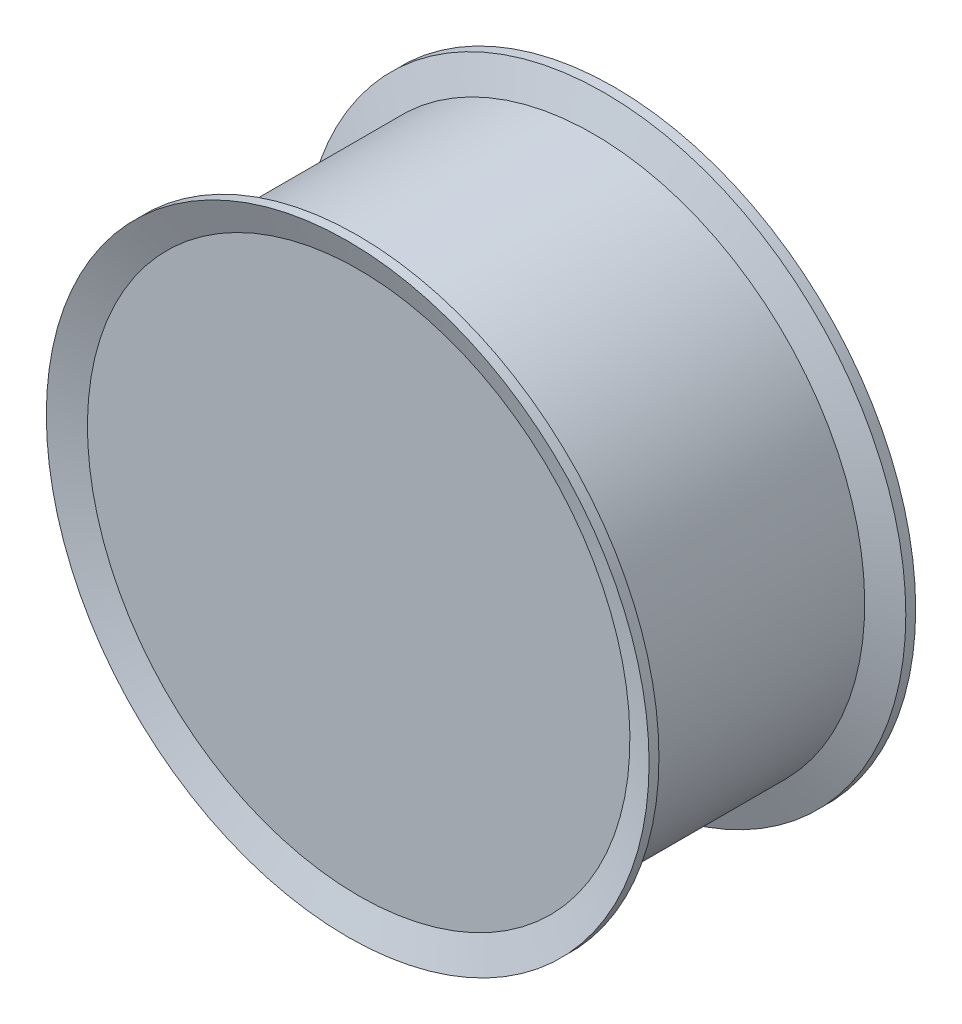
ISO-10303-21;
HEADER;
FILE_DESCRIPTION(('STEP AP214'),'2;1');
FILE_NAME('part.step','',(''),(''),'','','');
FILE_SCHEMA(('AUTOMOTIVE_DESIGN { 1 0 10303 214 1 1 1 1 }'));
ENDSEC;
DATA;
#1=APPLICATION_CONTEXT('core data for automotive mechanical design processes');
#2=APPLICATION_PROTOCOL_DEFINITION('international standard','automotive_design',2000,#1);
#3=PRODUCT_CONTEXT('',#1,'mechanical');
#4=PRODUCT('Part','Part','',(#3));
#5=PRODUCT_RELATED_PRODUCT_CATEGORY('part','',(#4));
#6=PRODUCT_DEFINITION_FORMATION('','',#4);
#7=PRODUCT_DEFINITION_CONTEXT('part definition',#1,'design');
#8=PRODUCT_DEFINITION('design','',#6,#7);
#9=PRODUCT_DEFINITION_SHAPE('','',#8);
#10=(LENGTH_UNIT() NAMED_UNIT(*) SI_UNIT(.MILLI.,.METRE.));
#11=(NAMED_UNIT(*) PLANE_ANGLE_UNIT() SI_UNIT($,.RADIAN.));
#12=(NAMED_UNIT(*) SI_UNIT($,.STERADIAN.) SOLID_ANGLE_UNIT());
#13=UNCERTAINTY_MEASURE_WITH_UNIT(LENGTH_MEASURE(1.E-05),#10,'distance_accuracy_value','');
#14=(GEOMETRIC_REPRESENTATION_CONTEXT(3) GLOBAL_UNCERTAINTY_ASSIGNED_CONTEXT((#13)) GLOBAL_UNIT_ASSIGNED_CONTEXT((#10,
#11,#12)) REPRESENTATION_CONTEXT('',''));
#15=CARTESIAN_POINT('',(0.,0.,0.));
#16=DIRECTION('',(0.,0.,1.));
#17=DIRECTION('',(1.,0.,0.));
#18=AXIS2_PLACEMENT_3D('',#15,#16,#17);
#19=CARTESIAN_POINT('',(0.,117.,52.7683869545392));
#20=DIRECTION('',(0.,0.,-1.));
#21=DIRECTION('',(0.,1.,0.));
#22=AXIS2_PLACEMENT_3D('',#19,#20,#21);
#23=PLANE('',#22);
#24=CARTESIAN_POINT('',(0.,0.,52.7683869545392));
#25=DIRECTION('',(0.,0.,1.));
#26=DIRECTION('',(0.,-1.,0.));
#27=AXIS2_PLACEMENT_3D('',#24,#25,#26);
#28=CIRCLE('',#27,117.);
#29=CARTESIAN_POINT('',(0.,-117.,52.7683869545393));
#30=VERTEX_POINT('',#29);
#31=EDGE_CURVE('E59',#30,#30,#28,.T.);
#32=ORIENTED_EDGE('',*,*,#31,.T.);
#33=EDGE_LOOP('',(#32));
#34=FACE_BOUND('',#33,.T.);
#35=ADVANCED_FACE('F31',(#34),#23,.F.);
#36=CARTESIAN_POINT('',(0.,0.,-52.7683869545398));
#37=DIRECTION('',(0.,0.,1.));
#38=DIRECTION('',(0.,-1.,0.));
#39=AXIS2_PLACEMENT_3D('',#36,#37,#38);
#40=PLANE('',#39);
#41=CARTESIAN_POINT('',(0.,0.,-52.7683869545397));
#42=DIRECTION('',(0.,0.,1.));
#43=DIRECTION('',(0.,-1.,0.));
#44=AXIS2_PLACEMENT_3D('',#41,#42,#43);
#45=CIRCLE('',#44,117.);
#46=CARTESIAN_POINT('',(0.,-117.,-52.7683869545397));
#47=VERTEX_POINT('',#46);
#48=EDGE_CURVE('E10',#47,#47,#45,.T.);
#49=ORIENTED_EDGE('',*,*,#48,.F.);
#50=EDGE_LOOP('',(#49));
#51=FACE_BOUND('',#50,.T.);
#52=ADVANCED_FACE('F101',(#51),#40,.F.);
#53=CARTESIAN_POINT('',(0.,0.,-52.7683869545397));
#54=DIRECTION('',(0.,0.,-1.));
#55=DIRECTION('',(0.,1.,0.));
#56=AXIS2_PLACEMENT_3D('',#53,#54,#55);
#57=CONICAL_SURFACE('',#56,117.,1.22173047639606);
#58=CARTESIAN_POINT('',(0.,0.,-57.5));
#59=DIRECTION('',(0.,0.,1.));
#60=DIRECTION('',(0.,-1.,0.));
#61=AXIS2_PLACEMENT_3D('',#58,#59,#60);
#62=CIRCLE('',#61,130.);
#63=CARTESIAN_POINT('',(0.,-130.,-57.5));
#64=VERTEX_POINT('',#63);
#65=EDGE_CURVE('E37',#64,#64,#62,.T.);
#66=ORIENTED_EDGE('',*,*,#65,.F.);
#67=EDGE_LOOP('',(#66));
#68=FACE_BOUND('',#67,.T.);
#69=ORIENTED_EDGE('',*,*,#48,.T.);
#70=EDGE_LOOP('',(#69));
#71=FACE_BOUND('',#70,.T.);
#72=ADVANCED_FACE('F96',(#68,#71),#57,.F.);
#73=CARTESIAN_POINT('',(0.,0.,52.7683869545392));
#74=DIRECTION('',(0.,0.,1.));
#75=DIRECTION('',(0.,-1.,0.));
#76=AXIS2_PLACEMENT_3D('',#73,#74,#75);
#77=CYLINDRICAL_SURFACE('',#76,130.);
#78=CARTESIAN_POINT('',(0.,0.,-53.2432889100963));
#79=DIRECTION('',(0.,0.,1.));
#80=DIRECTION('',(0.,-1.,0.));
#81=AXIS2_PLACEMENT_3D('',#78,#79,#80);
#82=CIRCLE('',#81,130.);
#83=CARTESIAN_POINT('',(0.,-130.,-53.2432889100963));
#84=VERTEX_POINT('',#83);
#85=EDGE_CURVE('E41',#84,#84,#82,.T.);
#86=ORIENTED_EDGE('',*,*,#85,.F.);
#87=EDGE_LOOP('',(#86));
#88=FACE_BOUND('',#87,.T.);
#89=ORIENTED_EDGE('',*,*,#65,.T.);
#90=EDGE_LOOP('',(#89));
#91=FACE_BOUND('',#90,.T.);
#92=ADVANCED_FACE('F91',(#88,#91),#77,.T.);
#93=CARTESIAN_POINT('',(0.,0.,-53.2432889100963));
#94=DIRECTION('',(0.,0.,-1.));
#95=DIRECTION('',(0.,1.,0.));
#96=AXIS2_PLACEMENT_3D('',#93,#94,#95);
#97=CONICAL_SURFACE('',#96,130.,1.22173047639603);
#98=CARTESIAN_POINT('',(0.,0.,-48.5116758646355));
#99=DIRECTION('',(0.,0.,1.));
#100=DIRECTION('',(0.,-1.,0.));
#101=AXIS2_PLACEMENT_3D('',#98,#99,#100);
#102=CIRCLE('',#101,117.);
#103=CARTESIAN_POINT('',(0.,-117.,-48.5116758646355));
#104=VERTEX_POINT('',#103);
#105=EDGE_CURVE('E45',#104,#104,#102,.T.);
#106=ORIENTED_EDGE('',*,*,#105,.F.);
#107=EDGE_LOOP('',(#106));
#108=FACE_BOUND('',#107,.T.);
#109=ORIENTED_EDGE('',*,*,#85,.T.);
#110=EDGE_LOOP('',(#109));
#111=FACE_BOUND('',#110,.T.);
#112=ADVANCED_FACE('F85',(#108,#111),#97,.T.);
#113=CARTESIAN_POINT('',(0.,0.,52.7683869545392));
#114=DIRECTION('',(0.,0.,1.));
#115=DIRECTION('',(0.,-1.,0.));
#116=AXIS2_PLACEMENT_3D('',#113,#114,#115);
#117=CYLINDRICAL_SURFACE('',#116,117.);
#118=CARTESIAN_POINT('',(0.,0.,48.5116758646356));
#119=DIRECTION('',(0.,0.,1.));
#120=DIRECTION('',(0.,-1.,0.));
#121=AXIS2_PLACEMENT_3D('',#118,#119,#120);
#122=CIRCLE('',#121,117.);
#123=CARTESIAN_POINT('',(0.,-117.,48.5116758646356));
#124=VERTEX_POINT('',#123);
#125=EDGE_CURVE('E50',#124,#124,#122,.T.);
#126=ORIENTED_EDGE('',*,*,#125,.F.);
#127=EDGE_LOOP('',(#126));
#128=FACE_BOUND('',#127,.T.);
#129=ORIENTED_EDGE('',*,*,#105,.T.);
#130=EDGE_LOOP('',(#129));
#131=FACE_BOUND('',#130,.T.);
#132=ADVANCED_FACE('F79',(#128,#131),#117,.T.);
#133=CARTESIAN_POINT('',(0.,0.,48.5116758646356));
#134=DIRECTION('',(0.,0.,1.));
#135=DIRECTION('',(0.,-1.,0.));
#136=AXIS2_PLACEMENT_3D('',#133,#134,#135);
#137=CONICAL_SURFACE('',#136,117.,1.22173047639604);
#138=CARTESIAN_POINT('',(0.,0.,53.2432889100962));
#139=DIRECTION('',(0.,0.,1.));
#140=DIRECTION('',(0.,-1.,0.));
#141=AXIS2_PLACEMENT_3D('',#138,#139,#140);
#142=CIRCLE('',#141,130.);
#143=CARTESIAN_POINT('',(0.,-130.,53.2432889100962));
#144=VERTEX_POINT('',#143);
#145=EDGE_CURVE('E53',#144,#144,#142,.T.);
#146=ORIENTED_EDGE('',*,*,#145,.F.);
#147=EDGE_LOOP('',(#146));
#148=FACE_BOUND('',#147,.T.);
#149=ORIENTED_EDGE('',*,*,#125,.T.);
#150=EDGE_LOOP('',(#149));
#151=FACE_BOUND('',#150,.T.);
#152=ADVANCED_FACE('F73',(#148,#151),#137,.T.);
#153=CARTESIAN_POINT('',(0.,0.,52.7683869545392));
#154=DIRECTION('',(0.,0.,1.));
#155=DIRECTION('',(0.,-1.,0.));
#156=AXIS2_PLACEMENT_3D('',#153,#154,#155);
#157=CYLINDRICAL_SURFACE('',#156,130.);
#158=CARTESIAN_POINT('',(0.,0.,57.5));
#159=DIRECTION('',(0.,0.,1.));
#160=DIRECTION('',(0.,-1.,0.));
#161=AXIS2_PLACEMENT_3D('',#158,#159,#160);
#162=CIRCLE('',#161,130.);
#163=CARTESIAN_POINT('',(0.,-130.,57.5));
#164=VERTEX_POINT('',#163);
#165=EDGE_CURVE('E56',#164,#164,#162,.T.);
#166=ORIENTED_EDGE('',*,*,#165,.F.);
#167=EDGE_LOOP('',(#166));
#168=FACE_BOUND('',#167,.T.);
#169=ORIENTED_EDGE('',*,*,#145,.T.);
#170=EDGE_LOOP('',(#169));
#171=FACE_BOUND('',#170,.T.);
#172=ADVANCED_FACE('F67',(#168,#171),#157,.T.);
#173=CARTESIAN_POINT('',(0.,0.,57.5));
#174=DIRECTION('',(0.,0.,1.));
#175=DIRECTION('',(0.,-1.,0.));
#176=AXIS2_PLACEMENT_3D('',#173,#174,#175);
#177=CONICAL_SURFACE('',#176,130.,1.22173047639602);
#178=ORIENTED_EDGE('',*,*,#31,.F.);
#179=EDGE_LOOP('',(#178));
#180=FACE_BOUND('',#179,.T.);
#181=ORIENTED_EDGE('',*,*,#165,.T.);
#182=EDGE_LOOP('',(#181));
#183=FACE_BOUND('',#182,.T.);
#184=ADVANCED_FACE('F64',(#180,#183),#177,.F.);
#185=CLOSED_SHELL('',(#35,#52,#72,#92,#112,#132,#152,#172,#184));
#186=MANIFOLD_SOLID_BREP('B2',#185);
#187=ADVANCED_BREP_SHAPE_REPRESENTATION('',(#18,#186),#14);
#188=SHAPE_DEFINITION_REPRESENTATION(#9,#187);
ENDSEC;
END-ISO-10303-21;
